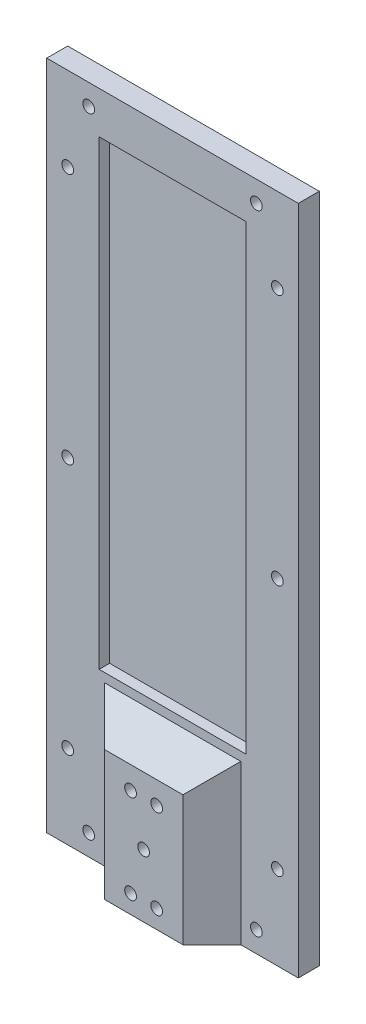
ISO-10303-21;
HEADER;
FILE_DESCRIPTION(('STEP AP214'),'2;1');
FILE_NAME('part.step','',(''),(''),'','','');
FILE_SCHEMA(('AUTOMOTIVE_DESIGN { 1 0 10303 214 1 1 1 1 }'));
ENDSEC;
DATA;
#1=APPLICATION_CONTEXT('core data for automotive mechanical design processes');
#2=APPLICATION_PROTOCOL_DEFINITION('international standard','automotive_design',2000,#1);
#3=PRODUCT_CONTEXT('',#1,'mechanical');
#4=PRODUCT('Part','Part','',(#3));
#5=PRODUCT_RELATED_PRODUCT_CATEGORY('part','',(#4));
#6=PRODUCT_DEFINITION_FORMATION('','',#4);
#7=PRODUCT_DEFINITION_CONTEXT('part definition',#1,'design');
#8=PRODUCT_DEFINITION('design','',#6,#7);
#9=PRODUCT_DEFINITION_SHAPE('','',#8);
#10=(LENGTH_UNIT() NAMED_UNIT(*) SI_UNIT(.MILLI.,.METRE.));
#11=(NAMED_UNIT(*) PLANE_ANGLE_UNIT() SI_UNIT($,.RADIAN.));
#12=(NAMED_UNIT(*) SI_UNIT($,.STERADIAN.) SOLID_ANGLE_UNIT());
#13=UNCERTAINTY_MEASURE_WITH_UNIT(LENGTH_MEASURE(1.E-05),#10,'distance_accuracy_value','');
#14=(GEOMETRIC_REPRESENTATION_CONTEXT(3) GLOBAL_UNCERTAINTY_ASSIGNED_CONTEXT((#13)) GLOBAL_UNIT_ASSIGNED_CONTEXT((#10,
#11,#12)) REPRESENTATION_CONTEXT('',''));
#15=CARTESIAN_POINT('',(0.,0.,0.));
#16=DIRECTION('',(0.,0.,1.));
#17=DIRECTION('',(1.,0.,0.));
#18=AXIS2_PLACEMENT_3D('',#15,#16,#17);
#19=CARTESIAN_POINT('',(0.,0.,6.35));
#20=DIRECTION('',(0.,0.,-1.));
#21=DIRECTION('',(-1.,0.,0.));
#22=AXIS2_PLACEMENT_3D('',#19,#20,#21);
#23=PLANE('',#22);
#24=DIRECTION('',(1.,0.,0.));
#25=VECTOR('',#24,1.);
#26=CARTESIAN_POINT('',(15.875,50.8,6.35));
#27=LINE('',#26,#25);
#28=CARTESIAN_POINT('',(15.875,50.8,6.35));
#29=VERTEX_POINT('',#28);
#30=CARTESIAN_POINT('',(60.325,50.8,6.35));
#31=VERTEX_POINT('',#30);
#32=EDGE_CURVE('E156',#29,#31,#27,.T.);
#33=ORIENTED_EDGE('',*,*,#32,.F.);
#34=DIRECTION('',(0.,-1.,0.));
#35=VECTOR('',#34,1.);
#36=CARTESIAN_POINT('',(15.875,190.5,6.35));
#37=LINE('',#36,#35);
#38=CARTESIAN_POINT('',(15.875,190.5,6.35));
#39=VERTEX_POINT('',#38);
#40=EDGE_CURVE('E130',#39,#29,#37,.T.);
#41=ORIENTED_EDGE('',*,*,#40,.F.);
#42=DIRECTION('',(-1.,0.,0.));
#43=VECTOR('',#42,1.);
#44=CARTESIAN_POINT('',(15.875,190.5,6.35));
#45=LINE('',#44,#43);
#46=CARTESIAN_POINT('',(60.325,190.5,6.35));
#47=VERTEX_POINT('',#46);
#48=EDGE_CURVE('E147',#47,#39,#45,.T.);
#49=ORIENTED_EDGE('',*,*,#48,.F.);
#50=DIRECTION('',(0.,1.,0.));
#51=VECTOR('',#50,1.);
#52=CARTESIAN_POINT('',(60.325,190.5,6.35));
#53=LINE('',#52,#51);
#54=EDGE_CURVE('E150',#31,#47,#53,.T.);
#55=ORIENTED_EDGE('',*,*,#54,.F.);
#56=EDGE_LOOP('',(#33,#41,#49,#55));
#57=FACE_BOUND('',#56,.T.);
#58=CARTESIAN_POINT('',(63.5,6.35,6.35));
#59=DIRECTION('',(0.,0.,-1.));
#60=DIRECTION('',(-1.,0.,0.));
#61=AXIS2_PLACEMENT_3D('',#58,#59,#60);
#62=CIRCLE('',#61,1.778);
#63=CARTESIAN_POINT('',(61.722,6.35,6.35));
#64=VERTEX_POINT('',#63);
#65=EDGE_CURVE('E251',#64,#64,#62,.T.);
#66=ORIENTED_EDGE('',*,*,#65,.T.);
#67=EDGE_LOOP('',(#66));
#68=FACE_BOUND('',#67,.T.);
#69=CARTESIAN_POINT('',(6.35,101.6,6.35));
#70=DIRECTION('',(0.,0.,-1.));
#71=DIRECTION('',(-1.,0.,0.));
#72=AXIS2_PLACEMENT_3D('',#69,#70,#71);
#73=CIRCLE('',#72,1.778);
#74=CARTESIAN_POINT('',(4.572,101.6,6.35));
#75=VERTEX_POINT('',#74);
#76=EDGE_CURVE('E197',#75,#75,#73,.T.);
#77=ORIENTED_EDGE('',*,*,#76,.T.);
#78=EDGE_LOOP('',(#77));
#79=FACE_BOUND('',#78,.T.);
#80=CARTESIAN_POINT('',(69.85,25.4,6.35));
#81=DIRECTION('',(0.,0.,-1.));
#82=DIRECTION('',(-1.,0.,0.));
#83=AXIS2_PLACEMENT_3D('',#80,#81,#82);
#84=CIRCLE('',#83,1.77800000000001);
#85=CARTESIAN_POINT('',(68.072,25.4,6.35));
#86=VERTEX_POINT('',#85);
#87=EDGE_CURVE('E234',#86,#86,#84,.T.);
#88=ORIENTED_EDGE('',*,*,#87,.T.);
#89=EDGE_LOOP('',(#88));
#90=FACE_BOUND('',#89,.T.);
#91=CARTESIAN_POINT('',(6.35,25.4,6.35));
#92=DIRECTION('',(0.,0.,-1.));
#93=DIRECTION('',(-1.,0.,0.));
#94=AXIS2_PLACEMENT_3D('',#91,#92,#93);
#95=CIRCLE('',#94,1.778);
#96=CARTESIAN_POINT('',(4.572,25.4,6.35));
#97=VERTEX_POINT('',#96);
#98=EDGE_CURVE('E227',#97,#97,#95,.T.);
#99=ORIENTED_EDGE('',*,*,#98,.T.);
#100=EDGE_LOOP('',(#99));
#101=FACE_BOUND('',#100,.T.);
#102=CARTESIAN_POINT('',(6.35,177.8,6.35));
#103=DIRECTION('',(0.,0.,-1.));
#104=DIRECTION('',(-1.,0.,0.));
#105=AXIS2_PLACEMENT_3D('',#102,#103,#104);
#106=CIRCLE('',#105,1.77799999999999);
#107=CARTESIAN_POINT('',(4.57200000000001,177.8,6.35));
#108=VERTEX_POINT('',#107);
#109=EDGE_CURVE('E246',#108,#108,#106,.T.);
#110=ORIENTED_EDGE('',*,*,#109,.T.);
#111=EDGE_LOOP('',(#110));
#112=FACE_BOUND('',#111,.T.);
#113=CARTESIAN_POINT('',(12.7,6.35,6.35));
#114=DIRECTION('',(0.,0.,-1.));
#115=DIRECTION('',(-1.,0.,0.));
#116=AXIS2_PLACEMENT_3D('',#113,#114,#115);
#117=CIRCLE('',#116,1.778);
#118=CARTESIAN_POINT('',(10.922,6.35,6.35));
#119=VERTEX_POINT('',#118);
#120=EDGE_CURVE('E239',#119,#119,#117,.T.);
#121=ORIENTED_EDGE('',*,*,#120,.T.);
#122=EDGE_LOOP('',(#121));
#123=FACE_BOUND('',#122,.T.);
#124=CARTESIAN_POINT('',(69.85,101.6,6.35));
#125=DIRECTION('',(0.,0.,-1.));
#126=DIRECTION('',(-1.,0.,0.));
#127=AXIS2_PLACEMENT_3D('',#124,#125,#126);
#128=CIRCLE('',#127,1.778);
#129=CARTESIAN_POINT('',(68.072,101.6,6.35));
#130=VERTEX_POINT('',#129);
#131=EDGE_CURVE('E210',#130,#130,#128,.T.);
#132=ORIENTED_EDGE('',*,*,#131,.T.);
#133=EDGE_LOOP('',(#132));
#134=FACE_BOUND('',#133,.T.);
#135=CARTESIAN_POINT('',(12.7,196.85,6.35));
#136=DIRECTION('',(0.,0.,-1.));
#137=DIRECTION('',(-1.,0.,0.));
#138=AXIS2_PLACEMENT_3D('',#135,#136,#137);
#139=CIRCLE('',#138,1.778);
#140=CARTESIAN_POINT('',(10.922,196.85,6.35));
#141=VERTEX_POINT('',#140);
#142=EDGE_CURVE('E203',#141,#141,#139,.T.);
#143=ORIENTED_EDGE('',*,*,#142,.T.);
#144=EDGE_LOOP('',(#143));
#145=FACE_BOUND('',#144,.T.);
#146=CARTESIAN_POINT('',(63.5,196.85,6.35));
#147=DIRECTION('',(0.,0.,-1.));
#148=DIRECTION('',(-1.,0.,0.));
#149=AXIS2_PLACEMENT_3D('',#146,#147,#148);
#150=CIRCLE('',#149,1.77799999999999);
#151=CARTESIAN_POINT('',(61.722,196.85,6.35));
#152=VERTEX_POINT('',#151);
#153=EDGE_CURVE('E222',#152,#152,#150,.T.);
#154=ORIENTED_EDGE('',*,*,#153,.T.);
#155=EDGE_LOOP('',(#154));
#156=FACE_BOUND('',#155,.T.);
#157=CARTESIAN_POINT('',(69.85,177.8,6.35));
#158=DIRECTION('',(0.,0.,-1.));
#159=DIRECTION('',(-1.,0.,0.));
#160=AXIS2_PLACEMENT_3D('',#157,#158,#159);
#161=CIRCLE('',#160,1.778);
#162=CARTESIAN_POINT('',(68.072,177.8,6.35));
#163=VERTEX_POINT('',#162);
#164=EDGE_CURVE('E215',#163,#163,#161,.T.);
#165=ORIENTED_EDGE('',*,*,#164,.T.);
#166=EDGE_LOOP('',(#165));
#167=FACE_BOUND('',#166,.T.);
#168=DIRECTION('',(1.,0.,0.));
#169=VECTOR('',#168,1.);
#170=CARTESIAN_POINT('',(0.,0.,6.35));
#171=LINE('',#170,#169);
#172=CARTESIAN_POINT('',(0.,0.,6.35));
#173=VERTEX_POINT('',#172);
#174=CARTESIAN_POINT('',(17.4319999999999,0.,6.35));
#175=VERTEX_POINT('',#174);
#176=EDGE_CURVE('E262',#173,#175,#171,.T.);
#177=ORIENTED_EDGE('',*,*,#176,.T.);
#178=DIRECTION('',(0.,1.,0.));
#179=VECTOR('',#178,1.);
#180=CARTESIAN_POINT('',(17.4319999999999,38.1,6.35));
#181=LINE('',#180,#179);
#182=CARTESIAN_POINT('',(17.4319999999999,48.1000000000001,6.35));
#183=VERTEX_POINT('',#182);
#184=EDGE_CURVE('E292',#175,#183,#181,.T.);
#185=ORIENTED_EDGE('',*,*,#184,.T.);
#186=DIRECTION('',(1.,0.,0.));
#187=VECTOR('',#186,1.);
#188=CARTESIAN_POINT('',(48.768,48.1000000000001,6.35));
#189=LINE('',#188,#187);
#190=CARTESIAN_POINT('',(58.7680000000001,48.1000000000001,6.35));
#191=VERTEX_POINT('',#190);
#192=EDGE_CURVE('E290',#183,#191,#189,.T.);
#193=ORIENTED_EDGE('',*,*,#192,.T.);
#194=DIRECTION('',(0.,-1.,0.));
#195=VECTOR('',#194,1.);
#196=CARTESIAN_POINT('',(58.7680000000001,0.,6.35));
#197=LINE('',#196,#195);
#198=CARTESIAN_POINT('',(58.7680000000001,0.,6.35));
#199=VERTEX_POINT('',#198);
#200=EDGE_CURVE('E288',#191,#199,#197,.T.);
#201=ORIENTED_EDGE('',*,*,#200,.T.);
#202=CARTESIAN_POINT('',(76.2,0.,6.35));
#203=VERTEX_POINT('',#202);
#204=EDGE_CURVE('E260',#199,#203,#171,.T.);
#205=ORIENTED_EDGE('',*,*,#204,.T.);
#206=DIRECTION('',(0.,1.,0.));
#207=VECTOR('',#206,1.);
#208=CARTESIAN_POINT('',(76.2,0.,6.35));
#209=LINE('',#208,#207);
#210=CARTESIAN_POINT('',(76.2,203.2,6.35));
#211=VERTEX_POINT('',#210);
#212=EDGE_CURVE('E265',#203,#211,#209,.T.);
#213=ORIENTED_EDGE('',*,*,#212,.T.);
#214=DIRECTION('',(-1.,0.,0.));
#215=VECTOR('',#214,1.);
#216=CARTESIAN_POINT('',(0.,203.2,6.35));
#217=LINE('',#216,#215);
#218=CARTESIAN_POINT('',(0.,203.2,6.35));
#219=VERTEX_POINT('',#218);
#220=EDGE_CURVE('E267',#211,#219,#217,.T.);
#221=ORIENTED_EDGE('',*,*,#220,.T.);
#222=DIRECTION('',(0.,-1.,0.));
#223=VECTOR('',#222,1.);
#224=CARTESIAN_POINT('',(0.,0.,6.35));
#225=LINE('',#224,#223);
#226=EDGE_CURVE('E257',#219,#173,#225,.T.);
#227=ORIENTED_EDGE('',*,*,#226,.T.);
#228=EDGE_LOOP('',(#177,#185,#193,#201,#205,#213,#221,#227));
#229=FACE_BOUND('',#228,.T.);
#230=ADVANCED_FACE('F35',(#57,#68,#79,#90,#101,#112,#123,#134,#145,#156,#167,#229),#23,.F.);
#231=CARTESIAN_POINT('',(0.,0.,6.35));
#232=DIRECTION('',(1.,0.,0.));
#233=DIRECTION('',(0.,0.,-1.));
#234=AXIS2_PLACEMENT_3D('',#231,#232,#233);
#235=PLANE('',#234);
#236=DIRECTION('',(0.,-1.,0.));
#237=VECTOR('',#236,1.);
#238=CARTESIAN_POINT('',(0.,0.,0.));
#239=LINE('',#238,#237);
#240=CARTESIAN_POINT('',(0.,203.2,0.));
#241=VERTEX_POINT('',#240);
#242=CARTESIAN_POINT('',(0.,0.,0.));
#243=VERTEX_POINT('',#242);
#244=EDGE_CURVE('E254',#241,#243,#239,.T.);
#245=ORIENTED_EDGE('',*,*,#244,.T.);
#246=DIRECTION('',(0.,0.,-1.));
#247=VECTOR('',#246,1.);
#248=CARTESIAN_POINT('',(0.,0.,6.35));
#249=LINE('',#248,#247);
#250=EDGE_CURVE('E285',#173,#243,#249,.T.);
#251=ORIENTED_EDGE('',*,*,#250,.F.);
#252=ORIENTED_EDGE('',*,*,#226,.F.);
#253=DIRECTION('',(0.,0.,-1.));
#254=VECTOR('',#253,1.);
#255=CARTESIAN_POINT('',(0.,203.2,6.35));
#256=LINE('',#255,#254);
#257=EDGE_CURVE('E269',#219,#241,#256,.T.);
#258=ORIENTED_EDGE('',*,*,#257,.T.);
#259=EDGE_LOOP('',(#245,#251,#252,#258));
#260=FACE_BOUND('',#259,.T.);
#261=ADVANCED_FACE('F334',(#260),#235,.F.);
#262=CARTESIAN_POINT('',(0.,0.,6.35));
#263=DIRECTION('',(0.,1.,0.));
#264=DIRECTION('',(0.,0.,1.));
#265=AXIS2_PLACEMENT_3D('',#262,#263,#264);
#266=PLANE('',#265);
#267=DIRECTION('',(1.,0.,0.));
#268=VECTOR('',#267,1.);
#269=CARTESIAN_POINT('',(0.,0.,0.));
#270=LINE('',#269,#268);
#271=CARTESIAN_POINT('',(76.2,0.,0.));
#272=VERTEX_POINT('',#271);
#273=EDGE_CURVE('E272',#243,#272,#270,.T.);
#274=ORIENTED_EDGE('',*,*,#273,.T.);
#275=DIRECTION('',(0.,0.,-1.));
#276=VECTOR('',#275,1.);
#277=CARTESIAN_POINT('',(76.2,0.,6.35));
#278=LINE('',#277,#276);
#279=EDGE_CURVE('E282',#203,#272,#278,.T.);
#280=ORIENTED_EDGE('',*,*,#279,.F.);
#281=ORIENTED_EDGE('',*,*,#204,.F.);
#282=DIRECTION('',(0.707106781186544,0.,-0.707106781186551));
#283=VECTOR('',#282,1.);
#284=CARTESIAN_POINT('',(29.3840000000003,0.,35.734));
#285=LINE('',#284,#283);
#286=CARTESIAN_POINT('',(50.0133842860002,0.,15.104615714));
#287=VERTEX_POINT('',#286);
#288=EDGE_CURVE('E11',#199,#287,#285,.F.);
#289=ORIENTED_EDGE('',*,*,#288,.T.);
#290=DIRECTION('',(1.,0.,0.));
#291=VECTOR('',#290,1.);
#292=CARTESIAN_POINT('',(27.432,0.,15.104615714));
#293=LINE('',#292,#291);
#294=CARTESIAN_POINT('',(26.1866157139998,0.,15.104615714));
#295=VERTEX_POINT('',#294);
#296=EDGE_CURVE('E53',#295,#287,#293,.T.);
#297=ORIENTED_EDGE('',*,*,#296,.F.);
#298=DIRECTION('',(0.707106781186544,0.,0.707106781186551));
#299=VECTOR('',#298,1.);
#300=CARTESIAN_POINT('',(8.71600000000006,0.,-2.36599999999997));
#301=LINE('',#300,#299);
#302=EDGE_CURVE('E297',#295,#175,#301,.F.);
#303=ORIENTED_EDGE('',*,*,#302,.T.);
#304=ORIENTED_EDGE('',*,*,#176,.F.);
#305=ORIENTED_EDGE('',*,*,#250,.T.);
#306=EDGE_LOOP('',(#274,#280,#281,#289,#297,#303,#304,#305));
#307=FACE_BOUND('',#306,.T.);
#308=ADVANCED_FACE('F319',(#307),#266,.F.);
#309=CARTESIAN_POINT('',(76.2,0.,6.35));
#310=DIRECTION('',(-1.,0.,0.));
#311=DIRECTION('',(0.,0.,1.));
#312=AXIS2_PLACEMENT_3D('',#309,#310,#311);
#313=PLANE('',#312);
#314=DIRECTION('',(0.,1.,0.));
#315=VECTOR('',#314,1.);
#316=CARTESIAN_POINT('',(76.2,0.,0.));
#317=LINE('',#316,#315);
#318=CARTESIAN_POINT('',(76.2,203.2,0.));
#319=VERTEX_POINT('',#318);
#320=EDGE_CURVE('E274',#272,#319,#317,.T.);
#321=ORIENTED_EDGE('',*,*,#320,.T.);
#322=DIRECTION('',(0.,0.,-1.));
#323=VECTOR('',#322,1.);
#324=CARTESIAN_POINT('',(76.2,203.2,6.35));
#325=LINE('',#324,#323);
#326=EDGE_CURVE('E279',#211,#319,#325,.T.);
#327=ORIENTED_EDGE('',*,*,#326,.F.);
#328=ORIENTED_EDGE('',*,*,#212,.F.);
#329=ORIENTED_EDGE('',*,*,#279,.T.);
#330=EDGE_LOOP('',(#321,#327,#328,#329));
#331=FACE_BOUND('',#330,.T.);
#332=ADVANCED_FACE('F324',(#331),#313,.F.);
#333=CARTESIAN_POINT('',(0.,203.2,6.35));
#334=DIRECTION('',(0.,-1.,0.));
#335=DIRECTION('',(0.,0.,-1.));
#336=AXIS2_PLACEMENT_3D('',#333,#334,#335);
#337=PLANE('',#336);
#338=DIRECTION('',(-1.,0.,0.));
#339=VECTOR('',#338,1.);
#340=CARTESIAN_POINT('',(0.,203.2,0.));
#341=LINE('',#340,#339);
#342=EDGE_CURVE('E261',#319,#241,#341,.T.);
#343=ORIENTED_EDGE('',*,*,#342,.T.);
#344=ORIENTED_EDGE('',*,*,#257,.F.);
#345=ORIENTED_EDGE('',*,*,#220,.F.);
#346=ORIENTED_EDGE('',*,*,#326,.T.);
#347=EDGE_LOOP('',(#343,#344,#345,#346));
#348=FACE_BOUND('',#347,.T.);
#349=ADVANCED_FACE('F330',(#348),#337,.F.);
#350=CARTESIAN_POINT('',(0.,0.,0.));
#351=DIRECTION('',(0.,0.,-1.));
#352=DIRECTION('',(-1.,0.,0.));
#353=AXIS2_PLACEMENT_3D('',#350,#351,#352);
#354=PLANE('',#353);
#355=CARTESIAN_POINT('',(38.1,19.05,0.));
#356=DIRECTION('',(0.,0.,1.));
#357=DIRECTION('',(1.,0.,0.));
#358=AXIS2_PLACEMENT_3D('',#355,#356,#357);
#359=CIRCLE('',#358,1.778);
#360=CARTESIAN_POINT('',(39.878,19.05,0.));
#361=VERTEX_POINT('',#360);
#362=EDGE_CURVE('E162',#361,#361,#359,.T.);
#363=ORIENTED_EDGE('',*,*,#362,.T.);
#364=EDGE_LOOP('',(#363));
#365=FACE_BOUND('',#364,.T.);
#366=CARTESIAN_POINT('',(34.1503,32.5247,0.));
#367=DIRECTION('',(0.,0.,1.));
#368=DIRECTION('',(1.,0.,0.));
#369=AXIS2_PLACEMENT_3D('',#366,#367,#368);
#370=CIRCLE('',#369,1.778);
#371=CARTESIAN_POINT('',(35.9283,32.5247,0.));
#372=VERTEX_POINT('',#371);
#373=EDGE_CURVE('E182',#372,#372,#370,.T.);
#374=ORIENTED_EDGE('',*,*,#373,.T.);
#375=EDGE_LOOP('',(#374));
#376=FACE_BOUND('',#375,.T.);
#377=CARTESIAN_POINT('',(42.0497,32.5247,0.));
#378=DIRECTION('',(0.,0.,1.));
#379=DIRECTION('',(1.,0.,0.));
#380=AXIS2_PLACEMENT_3D('',#377,#378,#379);
#381=CIRCLE('',#380,1.778);
#382=CARTESIAN_POINT('',(43.8277,32.5247,0.));
#383=VERTEX_POINT('',#382);
#384=EDGE_CURVE('E176',#383,#383,#381,.T.);
#385=ORIENTED_EDGE('',*,*,#384,.T.);
#386=EDGE_LOOP('',(#385));
#387=FACE_BOUND('',#386,.T.);
#388=CARTESIAN_POINT('',(42.0497,5.5753,0.));
#389=DIRECTION('',(0.,0.,1.));
#390=DIRECTION('',(1.,0.,0.));
#391=AXIS2_PLACEMENT_3D('',#388,#389,#390);
#392=CIRCLE('',#391,1.778);
#393=CARTESIAN_POINT('',(43.8277,5.5753,0.));
#394=VERTEX_POINT('',#393);
#395=EDGE_CURVE('E170',#394,#394,#392,.T.);
#396=ORIENTED_EDGE('',*,*,#395,.T.);
#397=EDGE_LOOP('',(#396));
#398=FACE_BOUND('',#397,.T.);
#399=CARTESIAN_POINT('',(34.1503,5.5753,0.));
#400=DIRECTION('',(0.,0.,1.));
#401=DIRECTION('',(1.,0.,0.));
#402=AXIS2_PLACEMENT_3D('',#399,#400,#401);
#403=CIRCLE('',#402,1.778);
#404=CARTESIAN_POINT('',(35.9283,5.5753,0.));
#405=VERTEX_POINT('',#404);
#406=EDGE_CURVE('E190',#405,#405,#403,.T.);
#407=ORIENTED_EDGE('',*,*,#406,.T.);
#408=EDGE_LOOP('',(#407));
#409=FACE_BOUND('',#408,.T.);
#410=CARTESIAN_POINT('',(69.85,177.8,0.));
#411=DIRECTION('',(0.,0.,-1.));
#412=DIRECTION('',(-1.,0.,0.));
#413=AXIS2_PLACEMENT_3D('',#410,#411,#412);
#414=CIRCLE('',#413,1.778);
#415=CARTESIAN_POINT('',(68.072,177.8,0.));
#416=VERTEX_POINT('',#415);
#417=EDGE_CURVE('E219',#416,#416,#414,.T.);
#418=ORIENTED_EDGE('',*,*,#417,.F.);
#419=EDGE_LOOP('',(#418));
#420=FACE_BOUND('',#419,.T.);
#421=CARTESIAN_POINT('',(63.5,196.85,0.));
#422=DIRECTION('',(0.,0.,-1.));
#423=DIRECTION('',(-1.,0.,0.));
#424=AXIS2_PLACEMENT_3D('',#421,#422,#423);
#425=CIRCLE('',#424,1.77799999999999);
#426=CARTESIAN_POINT('',(61.722,196.85,0.));
#427=VERTEX_POINT('',#426);
#428=EDGE_CURVE('E206',#427,#427,#425,.T.);
#429=ORIENTED_EDGE('',*,*,#428,.F.);
#430=EDGE_LOOP('',(#429));
#431=FACE_BOUND('',#430,.T.);
#432=CARTESIAN_POINT('',(12.7,196.85,0.));
#433=DIRECTION('',(0.,0.,-1.));
#434=DIRECTION('',(-1.,0.,0.));
#435=AXIS2_PLACEMENT_3D('',#432,#433,#434);
#436=CIRCLE('',#435,1.778);
#437=CARTESIAN_POINT('',(10.922,196.85,0.));
#438=VERTEX_POINT('',#437);
#439=EDGE_CURVE('E207',#438,#438,#436,.T.);
#440=ORIENTED_EDGE('',*,*,#439,.F.);
#441=EDGE_LOOP('',(#440));
#442=FACE_BOUND('',#441,.T.);
#443=CARTESIAN_POINT('',(69.85,101.6,0.));
#444=DIRECTION('',(0.,0.,-1.));
#445=DIRECTION('',(-1.,0.,0.));
#446=AXIS2_PLACEMENT_3D('',#443,#444,#445);
#447=CIRCLE('',#446,1.778);
#448=CARTESIAN_POINT('',(68.072,101.6,0.));
#449=VERTEX_POINT('',#448);
#450=EDGE_CURVE('E200',#449,#449,#447,.T.);
#451=ORIENTED_EDGE('',*,*,#450,.F.);
#452=EDGE_LOOP('',(#451));
#453=FACE_BOUND('',#452,.T.);
#454=CARTESIAN_POINT('',(12.7,6.35,0.));
#455=DIRECTION('',(0.,0.,-1.));
#456=DIRECTION('',(-1.,0.,0.));
#457=AXIS2_PLACEMENT_3D('',#454,#455,#456);
#458=CIRCLE('',#457,1.778);
#459=CARTESIAN_POINT('',(10.922,6.35,0.));
#460=VERTEX_POINT('',#459);
#461=EDGE_CURVE('E243',#460,#460,#458,.T.);
#462=ORIENTED_EDGE('',*,*,#461,.F.);
#463=EDGE_LOOP('',(#462));
#464=FACE_BOUND('',#463,.T.);
#465=CARTESIAN_POINT('',(6.35,177.8,0.));
#466=DIRECTION('',(0.,0.,-1.));
#467=DIRECTION('',(-1.,0.,0.));
#468=AXIS2_PLACEMENT_3D('',#465,#466,#467);
#469=CIRCLE('',#468,1.77799999999999);
#470=CARTESIAN_POINT('',(4.57200000000001,177.8,0.));
#471=VERTEX_POINT('',#470);
#472=EDGE_CURVE('E230',#471,#471,#469,.T.);
#473=ORIENTED_EDGE('',*,*,#472,.F.);
#474=EDGE_LOOP('',(#473));
#475=FACE_BOUND('',#474,.T.);
#476=CARTESIAN_POINT('',(6.35,25.4,0.));
#477=DIRECTION('',(0.,0.,-1.));
#478=DIRECTION('',(-1.,0.,0.));
#479=AXIS2_PLACEMENT_3D('',#476,#477,#478);
#480=CIRCLE('',#479,1.778);
#481=CARTESIAN_POINT('',(4.572,25.4,0.));
#482=VERTEX_POINT('',#481);
#483=EDGE_CURVE('E231',#482,#482,#480,.T.);
#484=ORIENTED_EDGE('',*,*,#483,.F.);
#485=EDGE_LOOP('',(#484));
#486=FACE_BOUND('',#485,.T.);
#487=CARTESIAN_POINT('',(69.85,25.4,0.));
#488=DIRECTION('',(0.,0.,-1.));
#489=DIRECTION('',(-1.,0.,0.));
#490=AXIS2_PLACEMENT_3D('',#487,#488,#489);
#491=CIRCLE('',#490,1.77800000000001);
#492=CARTESIAN_POINT('',(68.072,25.4,0.));
#493=VERTEX_POINT('',#492);
#494=EDGE_CURVE('E218',#493,#493,#491,.T.);
#495=ORIENTED_EDGE('',*,*,#494,.F.);
#496=EDGE_LOOP('',(#495));
#497=FACE_BOUND('',#496,.T.);
#498=CARTESIAN_POINT('',(6.35,101.6,0.));
#499=DIRECTION('',(0.,0.,-1.));
#500=DIRECTION('',(-1.,0.,0.));
#501=AXIS2_PLACEMENT_3D('',#498,#499,#500);
#502=CIRCLE('',#501,1.778);
#503=CARTESIAN_POINT('',(4.572,101.6,0.));
#504=VERTEX_POINT('',#503);
#505=EDGE_CURVE('E196',#504,#504,#502,.T.);
#506=ORIENTED_EDGE('',*,*,#505,.F.);
#507=EDGE_LOOP('',(#506));
#508=FACE_BOUND('',#507,.T.);
#509=CARTESIAN_POINT('',(63.5,6.35,0.));
#510=DIRECTION('',(0.,0.,-1.));
#511=DIRECTION('',(-1.,0.,0.));
#512=AXIS2_PLACEMENT_3D('',#509,#510,#511);
#513=CIRCLE('',#512,1.778);
#514=CARTESIAN_POINT('',(61.722,6.35,0.));
#515=VERTEX_POINT('',#514);
#516=EDGE_CURVE('E242',#515,#515,#513,.T.);
#517=ORIENTED_EDGE('',*,*,#516,.F.);
#518=EDGE_LOOP('',(#517));
#519=FACE_BOUND('',#518,.T.);
#520=ORIENTED_EDGE('',*,*,#244,.F.);
#521=ORIENTED_EDGE('',*,*,#342,.F.);
#522=ORIENTED_EDGE('',*,*,#320,.F.);
#523=ORIENTED_EDGE('',*,*,#273,.F.);
#524=EDGE_LOOP('',(#520,#521,#522,#523));
#525=FACE_BOUND('',#524,.T.);
#526=ADVANCED_FACE('F368',(#365,#376,#387,#398,#409,#420,#431,#442,#453,#464,#475,#486,#497,
#508,#519,#525),#354,.T.);
#527=CARTESIAN_POINT('',(63.5,6.35,6.35));
#528=DIRECTION('',(0.,0.,-1.));
#529=DIRECTION('',(-1.,0.,0.));
#530=AXIS2_PLACEMENT_3D('',#527,#528,#529);
#531=CYLINDRICAL_SURFACE('',#530,1.778);
#532=ORIENTED_EDGE('',*,*,#65,.F.);
#533=EDGE_LOOP('',(#532));
#534=FACE_BOUND('',#533,.T.);
#535=ORIENTED_EDGE('',*,*,#516,.T.);
#536=EDGE_LOOP('',(#535));
#537=FACE_BOUND('',#536,.T.);
#538=ADVANCED_FACE('F366',(#534,#537),#531,.F.);
#539=CARTESIAN_POINT('',(6.35,101.6,6.35));
#540=DIRECTION('',(0.,0.,-1.));
#541=DIRECTION('',(-1.,0.,0.));
#542=AXIS2_PLACEMENT_3D('',#539,#540,#541);
#543=CYLINDRICAL_SURFACE('',#542,1.778);
#544=ORIENTED_EDGE('',*,*,#76,.F.);
#545=EDGE_LOOP('',(#544));
#546=FACE_BOUND('',#545,.T.);
#547=ORIENTED_EDGE('',*,*,#505,.T.);
#548=EDGE_LOOP('',(#547));
#549=FACE_BOUND('',#548,.T.);
#550=ADVANCED_FACE('F457',(#546,#549),#543,.F.);
#551=CARTESIAN_POINT('',(69.85,25.4,6.35));
#552=DIRECTION('',(0.,0.,-1.));
#553=DIRECTION('',(-1.,0.,0.));
#554=AXIS2_PLACEMENT_3D('',#551,#552,#553);
#555=CYLINDRICAL_SURFACE('',#554,1.77800000000001);
#556=ORIENTED_EDGE('',*,*,#87,.F.);
#557=EDGE_LOOP('',(#556));
#558=FACE_BOUND('',#557,.T.);
#559=ORIENTED_EDGE('',*,*,#494,.T.);
#560=EDGE_LOOP('',(#559));
#561=FACE_BOUND('',#560,.T.);
#562=ADVANCED_FACE('F462',(#558,#561),#555,.F.);
#563=CARTESIAN_POINT('',(6.35,25.4,6.35));
#564=DIRECTION('',(0.,0.,-1.));
#565=DIRECTION('',(-1.,0.,0.));
#566=AXIS2_PLACEMENT_3D('',#563,#564,#565);
#567=CYLINDRICAL_SURFACE('',#566,1.778);
#568=ORIENTED_EDGE('',*,*,#98,.F.);
#569=EDGE_LOOP('',(#568));
#570=FACE_BOUND('',#569,.T.);
#571=ORIENTED_EDGE('',*,*,#483,.T.);
#572=EDGE_LOOP('',(#571));
#573=FACE_BOUND('',#572,.T.);
#574=ADVANCED_FACE('F497',(#570,#573),#567,.F.);
#575=CARTESIAN_POINT('',(6.35,177.8,6.35));
#576=DIRECTION('',(0.,0.,-1.));
#577=DIRECTION('',(-1.,0.,0.));
#578=AXIS2_PLACEMENT_3D('',#575,#576,#577);
#579=CYLINDRICAL_SURFACE('',#578,1.77799999999999);
#580=ORIENTED_EDGE('',*,*,#109,.F.);
#581=EDGE_LOOP('',(#580));
#582=FACE_BOUND('',#581,.T.);
#583=ORIENTED_EDGE('',*,*,#472,.T.);
#584=EDGE_LOOP('',(#583));
#585=FACE_BOUND('',#584,.T.);
#586=ADVANCED_FACE('F500',(#582,#585),#579,.F.);
#587=CARTESIAN_POINT('',(12.7,6.35,6.35));
#588=DIRECTION('',(0.,0.,-1.));
#589=DIRECTION('',(-1.,0.,0.));
#590=AXIS2_PLACEMENT_3D('',#587,#588,#589);
#591=CYLINDRICAL_SURFACE('',#590,1.778);
#592=ORIENTED_EDGE('',*,*,#120,.F.);
#593=EDGE_LOOP('',(#592));
#594=FACE_BOUND('',#593,.T.);
#595=ORIENTED_EDGE('',*,*,#461,.T.);
#596=EDGE_LOOP('',(#595));
#597=FACE_BOUND('',#596,.T.);
#598=ADVANCED_FACE('F505',(#594,#597),#591,.F.);
#599=CARTESIAN_POINT('',(69.85,101.6,6.35));
#600=DIRECTION('',(0.,0.,-1.));
#601=DIRECTION('',(-1.,0.,0.));
#602=AXIS2_PLACEMENT_3D('',#599,#600,#601);
#603=CYLINDRICAL_SURFACE('',#602,1.778);
#604=ORIENTED_EDGE('',*,*,#131,.F.);
#605=EDGE_LOOP('',(#604));
#606=FACE_BOUND('',#605,.T.);
#607=ORIENTED_EDGE('',*,*,#450,.T.);
#608=EDGE_LOOP('',(#607));
#609=FACE_BOUND('',#608,.T.);
#610=ADVANCED_FACE('F492',(#606,#609),#603,.F.);
#611=CARTESIAN_POINT('',(12.7,196.85,6.35));
#612=DIRECTION('',(0.,0.,-1.));
#613=DIRECTION('',(-1.,0.,0.));
#614=AXIS2_PLACEMENT_3D('',#611,#612,#613);
#615=CYLINDRICAL_SURFACE('',#614,1.778);
#616=ORIENTED_EDGE('',*,*,#142,.F.);
#617=EDGE_LOOP('',(#616));
#618=FACE_BOUND('',#617,.T.);
#619=ORIENTED_EDGE('',*,*,#439,.T.);
#620=EDGE_LOOP('',(#619));
#621=FACE_BOUND('',#620,.T.);
#622=ADVANCED_FACE('F487',(#618,#621),#615,.F.);
#623=CARTESIAN_POINT('',(63.5,196.85,6.35));
#624=DIRECTION('',(0.,0.,-1.));
#625=DIRECTION('',(-1.,0.,0.));
#626=AXIS2_PLACEMENT_3D('',#623,#624,#625);
#627=CYLINDRICAL_SURFACE('',#626,1.77799999999999);
#628=ORIENTED_EDGE('',*,*,#153,.F.);
#629=EDGE_LOOP('',(#628));
#630=FACE_BOUND('',#629,.T.);
#631=ORIENTED_EDGE('',*,*,#428,.T.);
#632=EDGE_LOOP('',(#631));
#633=FACE_BOUND('',#632,.T.);
#634=ADVANCED_FACE('F350',(#630,#633),#627,.F.);
#635=CARTESIAN_POINT('',(69.85,177.8,6.35));
#636=DIRECTION('',(0.,0.,-1.));
#637=DIRECTION('',(-1.,0.,0.));
#638=AXIS2_PLACEMENT_3D('',#635,#636,#637);
#639=CYLINDRICAL_SURFACE('',#638,1.778);
#640=ORIENTED_EDGE('',*,*,#164,.F.);
#641=EDGE_LOOP('',(#640));
#642=FACE_BOUND('',#641,.T.);
#643=ORIENTED_EDGE('',*,*,#417,.T.);
#644=EDGE_LOOP('',(#643));
#645=FACE_BOUND('',#644,.T.);
#646=ADVANCED_FACE('F340',(#642,#645),#639,.F.);
#647=CARTESIAN_POINT('',(0.,0.,15.104615714));
#648=DIRECTION('',(0.,0.,-1.));
#649=DIRECTION('',(-1.,0.,0.));
#650=AXIS2_PLACEMENT_3D('',#647,#648,#649);
#651=PLANE('',#650);
#652=CARTESIAN_POINT('',(38.1,19.05,15.104615714));
#653=DIRECTION('',(0.,0.,1.));
#654=DIRECTION('',(1.,0.,0.));
#655=AXIS2_PLACEMENT_3D('',#652,#653,#654);
#656=CIRCLE('',#655,1.778);
#657=CARTESIAN_POINT('',(39.878,19.05,15.104615714));
#658=VERTEX_POINT('',#657);
#659=EDGE_CURVE('E185',#658,#658,#656,.T.);
#660=ORIENTED_EDGE('',*,*,#659,.F.);
#661=EDGE_LOOP('',(#660));
#662=FACE_BOUND('',#661,.T.);
#663=CARTESIAN_POINT('',(34.1503,32.5247,15.104615714));
#664=DIRECTION('',(0.,0.,1.));
#665=DIRECTION('',(1.,0.,0.));
#666=AXIS2_PLACEMENT_3D('',#663,#664,#665);
#667=CIRCLE('',#666,1.778);
#668=CARTESIAN_POINT('',(35.9283,32.5247,15.104615714));
#669=VERTEX_POINT('',#668);
#670=EDGE_CURVE('E179',#669,#669,#667,.T.);
#671=ORIENTED_EDGE('',*,*,#670,.F.);
#672=EDGE_LOOP('',(#671));
#673=FACE_BOUND('',#672,.T.);
#674=CARTESIAN_POINT('',(42.0497,32.5247,15.104615714));
#675=DIRECTION('',(0.,0.,1.));
#676=DIRECTION('',(1.,0.,0.));
#677=AXIS2_PLACEMENT_3D('',#674,#675,#676);
#678=CIRCLE('',#677,1.778);
#679=CARTESIAN_POINT('',(43.8277,32.5247,15.104615714));
#680=VERTEX_POINT('',#679);
#681=EDGE_CURVE('E173',#680,#680,#678,.T.);
#682=ORIENTED_EDGE('',*,*,#681,.F.);
#683=EDGE_LOOP('',(#682));
#684=FACE_BOUND('',#683,.T.);
#685=CARTESIAN_POINT('',(42.0497,5.5753,15.104615714));
#686=DIRECTION('',(0.,0.,1.));
#687=DIRECTION('',(1.,0.,0.));
#688=AXIS2_PLACEMENT_3D('',#685,#686,#687);
#689=CIRCLE('',#688,1.778);
#690=CARTESIAN_POINT('',(43.8277,5.5753,15.104615714));
#691=VERTEX_POINT('',#690);
#692=EDGE_CURVE('E166',#691,#691,#689,.T.);
#693=ORIENTED_EDGE('',*,*,#692,.F.);
#694=EDGE_LOOP('',(#693));
#695=FACE_BOUND('',#694,.T.);
#696=CARTESIAN_POINT('',(34.1503,5.5753,15.104615714));
#697=DIRECTION('',(0.,0.,1.));
#698=DIRECTION('',(1.,0.,0.));
#699=AXIS2_PLACEMENT_3D('',#696,#697,#698);
#700=CIRCLE('',#699,1.778);
#701=CARTESIAN_POINT('',(35.9283,5.5753,15.104615714));
#702=VERTEX_POINT('',#701);
#703=EDGE_CURVE('E169',#702,#702,#700,.T.);
#704=ORIENTED_EDGE('',*,*,#703,.F.);
#705=EDGE_LOOP('',(#704));
#706=FACE_BOUND('',#705,.T.);
#707=ORIENTED_EDGE('',*,*,#296,.T.);
#708=DIRECTION('',(0.,-1.,0.));
#709=VECTOR('',#708,1.);
#710=CARTESIAN_POINT('',(50.0133842860002,0.,15.104615714));
#711=LINE('',#710,#709);
#712=CARTESIAN_POINT('',(50.0133842860002,39.3453842860002,15.104615714));
#713=VERTEX_POINT('',#712);
#714=EDGE_CURVE('E45',#287,#713,#711,.F.);
#715=ORIENTED_EDGE('',*,*,#714,.T.);
#716=DIRECTION('',(1.,0.,0.));
#717=VECTOR('',#716,1.);
#718=CARTESIAN_POINT('',(0.,39.3453842860002,15.104615714));
#719=LINE('',#718,#717);
#720=CARTESIAN_POINT('',(26.1866157139998,39.3453842860002,15.104615714));
#721=VERTEX_POINT('',#720);
#722=EDGE_CURVE('E299',#713,#721,#719,.F.);
#723=ORIENTED_EDGE('',*,*,#722,.T.);
#724=DIRECTION('',(0.,1.,0.));
#725=VECTOR('',#724,1.);
#726=CARTESIAN_POINT('',(26.1866157139998,0.,15.104615714));
#727=LINE('',#726,#725);
#728=EDGE_CURVE('E295',#721,#295,#727,.F.);
#729=ORIENTED_EDGE('',*,*,#728,.T.);
#730=EDGE_LOOP('',(#707,#715,#723,#729));
#731=FACE_BOUND('',#730,.T.);
#732=ADVANCED_FACE('F337',(#662,#673,#684,#695,#706,#731),#651,.F.);
#733=CARTESIAN_POINT('',(34.1503,5.5753,0.));
#734=DIRECTION('',(0.,0.,1.));
#735=DIRECTION('',(1.,0.,0.));
#736=AXIS2_PLACEMENT_3D('',#733,#734,#735);
#737=CYLINDRICAL_SURFACE('',#736,1.778);
#738=ORIENTED_EDGE('',*,*,#406,.F.);
#739=EDGE_LOOP('',(#738));
#740=FACE_BOUND('',#739,.T.);
#741=ORIENTED_EDGE('',*,*,#703,.T.);
#742=EDGE_LOOP('',(#741));
#743=FACE_BOUND('',#742,.T.);
#744=ADVANCED_FACE('F339',(#740,#743),#737,.F.);
#745=CARTESIAN_POINT('',(42.0497,5.5753,0.));
#746=DIRECTION('',(0.,0.,1.));
#747=DIRECTION('',(1.,0.,0.));
#748=AXIS2_PLACEMENT_3D('',#745,#746,#747);
#749=CYLINDRICAL_SURFACE('',#748,1.778);
#750=ORIENTED_EDGE('',*,*,#395,.F.);
#751=EDGE_LOOP('',(#750));
#752=FACE_BOUND('',#751,.T.);
#753=ORIENTED_EDGE('',*,*,#692,.T.);
#754=EDGE_LOOP('',(#753));
#755=FACE_BOUND('',#754,.T.);
#756=ADVANCED_FACE('F347',(#752,#755),#749,.F.);
#757=CARTESIAN_POINT('',(42.0497,32.5247,0.));
#758=DIRECTION('',(0.,0.,1.));
#759=DIRECTION('',(1.,0.,0.));
#760=AXIS2_PLACEMENT_3D('',#757,#758,#759);
#761=CYLINDRICAL_SURFACE('',#760,1.778);
#762=ORIENTED_EDGE('',*,*,#384,.F.);
#763=EDGE_LOOP('',(#762));
#764=FACE_BOUND('',#763,.T.);
#765=ORIENTED_EDGE('',*,*,#681,.T.);
#766=EDGE_LOOP('',(#765));
#767=FACE_BOUND('',#766,.T.);
#768=ADVANCED_FACE('F411',(#764,#767),#761,.F.);
#769=CARTESIAN_POINT('',(34.1503,32.5247,0.));
#770=DIRECTION('',(0.,0.,1.));
#771=DIRECTION('',(1.,0.,0.));
#772=AXIS2_PLACEMENT_3D('',#769,#770,#771);
#773=CYLINDRICAL_SURFACE('',#772,1.778);
#774=ORIENTED_EDGE('',*,*,#373,.F.);
#775=EDGE_LOOP('',(#774));
#776=FACE_BOUND('',#775,.T.);
#777=ORIENTED_EDGE('',*,*,#670,.T.);
#778=EDGE_LOOP('',(#777));
#779=FACE_BOUND('',#778,.T.);
#780=ADVANCED_FACE('F415',(#776,#779),#773,.F.);
#781=CARTESIAN_POINT('',(38.1,19.05,0.));
#782=DIRECTION('',(0.,0.,1.));
#783=DIRECTION('',(1.,0.,0.));
#784=AXIS2_PLACEMENT_3D('',#781,#782,#783);
#785=CYLINDRICAL_SURFACE('',#784,1.778);
#786=ORIENTED_EDGE('',*,*,#362,.F.);
#787=EDGE_LOOP('',(#786));
#788=FACE_BOUND('',#787,.T.);
#789=ORIENTED_EDGE('',*,*,#659,.T.);
#790=EDGE_LOOP('',(#789));
#791=FACE_BOUND('',#790,.T.);
#792=ADVANCED_FACE('F408',(#788,#791),#785,.F.);
#793=CARTESIAN_POINT('',(15.875,190.5,3.175));
#794=DIRECTION('',(-1.,0.,0.));
#795=DIRECTION('',(0.,-1.,0.));
#796=AXIS2_PLACEMENT_3D('',#793,#794,#795);
#797=PLANE('',#796);
#798=ORIENTED_EDGE('',*,*,#40,.T.);
#799=DIRECTION('',(0.,0.,1.));
#800=VECTOR('',#799,1.);
#801=CARTESIAN_POINT('',(15.875,50.8,3.175));
#802=LINE('',#801,#800);
#803=CARTESIAN_POINT('',(15.875,50.8,3.175));
#804=VERTEX_POINT('',#803);
#805=EDGE_CURVE('E123',#804,#29,#802,.T.);
#806=ORIENTED_EDGE('',*,*,#805,.F.);
#807=DIRECTION('',(0.,-1.,0.));
#808=VECTOR('',#807,1.);
#809=CARTESIAN_POINT('',(15.875,190.5,3.175));
#810=LINE('',#809,#808);
#811=CARTESIAN_POINT('',(15.875,190.5,3.175));
#812=VERTEX_POINT('',#811);
#813=EDGE_CURVE('E127',#812,#804,#810,.T.);
#814=ORIENTED_EDGE('',*,*,#813,.F.);
#815=DIRECTION('',(0.,0.,1.));
#816=VECTOR('',#815,1.);
#817=CARTESIAN_POINT('',(15.875,190.5,3.175));
#818=LINE('',#817,#816);
#819=EDGE_CURVE('E160',#812,#39,#818,.T.);
#820=ORIENTED_EDGE('',*,*,#819,.T.);
#821=EDGE_LOOP('',(#798,#806,#814,#820));
#822=FACE_BOUND('',#821,.T.);
#823=ADVANCED_FACE('F125',(#822),#797,.F.);
#824=CARTESIAN_POINT('',(15.875,190.5,3.175));
#825=DIRECTION('',(0.,1.,0.));
#826=DIRECTION('',(0.,0.,1.));
#827=AXIS2_PLACEMENT_3D('',#824,#825,#826);
#828=PLANE('',#827);
#829=ORIENTED_EDGE('',*,*,#48,.T.);
#830=ORIENTED_EDGE('',*,*,#819,.F.);
#831=DIRECTION('',(-1.,0.,0.));
#832=VECTOR('',#831,1.);
#833=CARTESIAN_POINT('',(15.875,190.5,3.175));
#834=LINE('',#833,#832);
#835=CARTESIAN_POINT('',(60.325,190.5,3.175));
#836=VERTEX_POINT('',#835);
#837=EDGE_CURVE('E135',#836,#812,#834,.T.);
#838=ORIENTED_EDGE('',*,*,#837,.F.);
#839=DIRECTION('',(0.,0.,1.));
#840=VECTOR('',#839,1.);
#841=CARTESIAN_POINT('',(60.325,190.5,3.175));
#842=LINE('',#841,#840);
#843=EDGE_CURVE('E163',#836,#47,#842,.T.);
#844=ORIENTED_EDGE('',*,*,#843,.T.);
#845=EDGE_LOOP('',(#829,#830,#838,#844));
#846=FACE_BOUND('',#845,.T.);
#847=ADVANCED_FACE('F399',(#846),#828,.F.);
#848=CARTESIAN_POINT('',(60.325,190.5,3.175));
#849=DIRECTION('',(1.,0.,0.));
#850=DIRECTION('',(0.,1.,0.));
#851=AXIS2_PLACEMENT_3D('',#848,#849,#850);
#852=PLANE('',#851);
#853=ORIENTED_EDGE('',*,*,#54,.T.);
#854=ORIENTED_EDGE('',*,*,#843,.F.);
#855=DIRECTION('',(0.,1.,0.));
#856=VECTOR('',#855,1.);
#857=CARTESIAN_POINT('',(60.325,190.5,3.175));
#858=LINE('',#857,#856);
#859=CARTESIAN_POINT('',(60.325,50.8,3.175));
#860=VERTEX_POINT('',#859);
#861=EDGE_CURVE('E143',#860,#836,#858,.T.);
#862=ORIENTED_EDGE('',*,*,#861,.F.);
#863=DIRECTION('',(0.,0.,1.));
#864=VECTOR('',#863,1.);
#865=CARTESIAN_POINT('',(60.325,50.8,3.175));
#866=LINE('',#865,#864);
#867=EDGE_CURVE('E134',#860,#31,#866,.T.);
#868=ORIENTED_EDGE('',*,*,#867,.T.);
#869=EDGE_LOOP('',(#853,#854,#862,#868));
#870=FACE_BOUND('',#869,.T.);
#871=ADVANCED_FACE('F396',(#870),#852,.F.);
#872=CARTESIAN_POINT('',(15.875,50.8,3.175));
#873=DIRECTION('',(0.,-1.,0.));
#874=DIRECTION('',(1.,0.,0.));
#875=AXIS2_PLACEMENT_3D('',#872,#873,#874);
#876=PLANE('',#875);
#877=ORIENTED_EDGE('',*,*,#32,.T.);
#878=ORIENTED_EDGE('',*,*,#867,.F.);
#879=DIRECTION('',(1.,0.,0.));
#880=VECTOR('',#879,1.);
#881=CARTESIAN_POINT('',(15.875,50.8,3.175));
#882=LINE('',#881,#880);
#883=EDGE_CURVE('E138',#804,#860,#882,.T.);
#884=ORIENTED_EDGE('',*,*,#883,.F.);
#885=ORIENTED_EDGE('',*,*,#805,.T.);
#886=EDGE_LOOP('',(#877,#878,#884,#885));
#887=FACE_BOUND('',#886,.T.);
#888=ADVANCED_FACE('F139',(#887),#876,.F.);
#889=CARTESIAN_POINT('',(0.,0.,3.175));
#890=DIRECTION('',(0.,0.,1.));
#891=DIRECTION('',(1.,0.,0.));
#892=AXIS2_PLACEMENT_3D('',#889,#890,#891);
#893=PLANE('',#892);
#894=ORIENTED_EDGE('',*,*,#813,.T.);
#895=ORIENTED_EDGE('',*,*,#883,.T.);
#896=ORIENTED_EDGE('',*,*,#861,.T.);
#897=ORIENTED_EDGE('',*,*,#837,.T.);
#898=EDGE_LOOP('',(#894,#895,#896,#897));
#899=FACE_BOUND('',#898,.T.);
#900=ADVANCED_FACE('F145',(#899),#893,.T.);
#901=CARTESIAN_POINT('',(48.768,0.,16.3500000000002));
#902=DIRECTION('',(0.707106781186551,0.,0.707106781186544));
#903=DIRECTION('',(0.,-1.,0.));
#904=AXIS2_PLACEMENT_3D('',#901,#902,#903);
#905=PLANE('',#904);
#906=ORIENTED_EDGE('',*,*,#288,.F.);
#907=ORIENTED_EDGE('',*,*,#200,.F.);
#908=DIRECTION('',(0.577350269189624,0.577350269189624,-0.57735026918963));
#909=VECTOR('',#908,1.);
#910=CARTESIAN_POINT('',(41.6560000000001,30.9880000000001,23.4620000000002));
#911=LINE('',#910,#909);
#912=EDGE_CURVE('E40',#713,#191,#911,.T.);
#913=ORIENTED_EDGE('',*,*,#912,.F.);
#914=ORIENTED_EDGE('',*,*,#714,.F.);
#915=EDGE_LOOP('',(#906,#907,#913,#914));
#916=FACE_BOUND('',#915,.T.);
#917=ADVANCED_FACE('F38',(#916),#905,.T.);
#918=CARTESIAN_POINT('',(27.432,38.1,16.3500000000002));
#919=DIRECTION('',(0.,0.707106781186551,0.707106781186544));
#920=DIRECTION('',(1.,0.,0.));
#921=AXIS2_PLACEMENT_3D('',#918,#919,#920);
#922=PLANE('',#921);
#923=ORIENTED_EDGE('',*,*,#912,.T.);
#924=ORIENTED_EDGE('',*,*,#192,.F.);
#925=DIRECTION('',(-0.577350269189624,0.577350269189624,-0.57735026918963));
#926=VECTOR('',#925,1.);
#927=CARTESIAN_POINT('',(40.1319999999999,25.4000000000001,29.0500000000002));
#928=LINE('',#927,#926);
#929=EDGE_CURVE('E301',#721,#183,#928,.T.);
#930=ORIENTED_EDGE('',*,*,#929,.F.);
#931=ORIENTED_EDGE('',*,*,#722,.F.);
#932=EDGE_LOOP('',(#923,#924,#930,#931));
#933=FACE_BOUND('',#932,.T.);
#934=ADVANCED_FACE('F311',(#933),#922,.T.);
#935=CARTESIAN_POINT('',(27.432,0.,16.3500000000002));
#936=DIRECTION('',(-0.707106781186551,0.,0.707106781186544));
#937=DIRECTION('',(0.,1.,0.));
#938=AXIS2_PLACEMENT_3D('',#935,#936,#937);
#939=PLANE('',#938);
#940=ORIENTED_EDGE('',*,*,#929,.T.);
#941=ORIENTED_EDGE('',*,*,#184,.F.);
#942=ORIENTED_EDGE('',*,*,#302,.F.);
#943=ORIENTED_EDGE('',*,*,#728,.F.);
#944=EDGE_LOOP('',(#940,#941,#942,#943));
#945=FACE_BOUND('',#944,.T.);
#946=ADVANCED_FACE('F336',(#945),#939,.T.);
#947=CLOSED_SHELL('',(#230,#261,#308,#332,#349,#526,#538,#550,#562,#574,#586,#598,#610,#622,
#634,#646,#732,#744,#756,#768,#780,#792,#823,#847,#871,#888,#900,#917,#934,#946));
#948=MANIFOLD_SOLID_BREP('B2',#947);
#949=ADVANCED_BREP_SHAPE_REPRESENTATION('',(#18,#948),#14);
#950=SHAPE_DEFINITION_REPRESENTATION(#9,#949);
ENDSEC;
END-ISO-10303-21;
